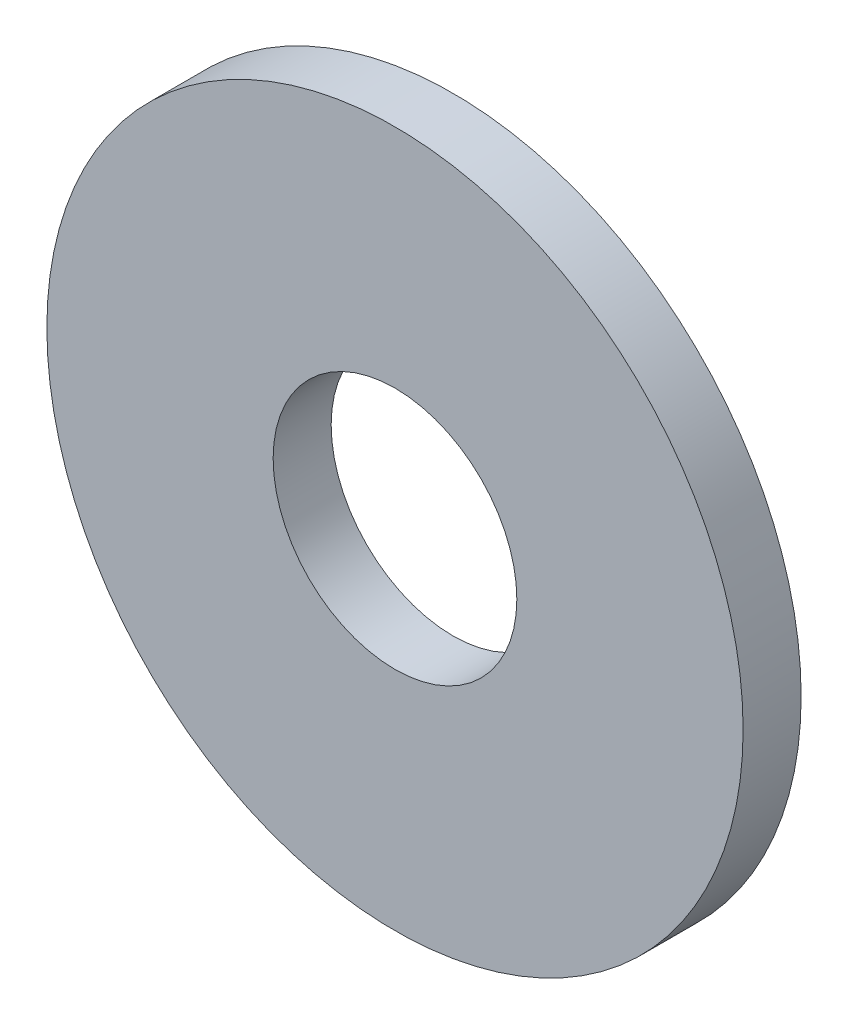
ISO-10303-21;
HEADER;
FILE_DESCRIPTION(('STEP AP214'),'2;1');
FILE_NAME('part.step','',(''),(''),'','','');
FILE_SCHEMA(('AUTOMOTIVE_DESIGN { 1 0 10303 214 1 1 1 1 }'));
ENDSEC;
DATA;
#1=APPLICATION_CONTEXT('core data for automotive mechanical design processes');
#2=APPLICATION_PROTOCOL_DEFINITION('international standard','automotive_design',2000,#1);
#3=PRODUCT_CONTEXT('',#1,'mechanical');
#4=PRODUCT('Part','Part','',(#3));
#5=PRODUCT_RELATED_PRODUCT_CATEGORY('part','',(#4));
#6=PRODUCT_DEFINITION_FORMATION('','',#4);
#7=PRODUCT_DEFINITION_CONTEXT('part definition',#1,'design');
#8=PRODUCT_DEFINITION('design','',#6,#7);
#9=PRODUCT_DEFINITION_SHAPE('','',#8);
#10=(LENGTH_UNIT() NAMED_UNIT(*) SI_UNIT(.MILLI.,.METRE.));
#11=(NAMED_UNIT(*) PLANE_ANGLE_UNIT() SI_UNIT($,.RADIAN.));
#12=(NAMED_UNIT(*) SI_UNIT($,.STERADIAN.) SOLID_ANGLE_UNIT());
#13=UNCERTAINTY_MEASURE_WITH_UNIT(LENGTH_MEASURE(1.E-05),#10,'distance_accuracy_value','');
#14=(GEOMETRIC_REPRESENTATION_CONTEXT(3) GLOBAL_UNCERTAINTY_ASSIGNED_CONTEXT((#13)) GLOBAL_UNIT_ASSIGNED_CONTEXT((#10,
#11,#12)) REPRESENTATION_CONTEXT('',''));
#15=CARTESIAN_POINT('',(0.,0.,0.));
#16=DIRECTION('',(0.,0.,1.));
#17=DIRECTION('',(1.,0.,0.));
#18=AXIS2_PLACEMENT_3D('',#15,#16,#17);
#19=CARTESIAN_POINT('',(0.,0.,1.25));
#20=DIRECTION('',(0.,0.,1.));
#21=DIRECTION('',(1.,0.,0.));
#22=AXIS2_PLACEMENT_3D('',#19,#20,#21);
#23=PLANE('',#22);
#24=CARTESIAN_POINT('',(0.,0.,1.25));
#25=DIRECTION('',(0.,0.,1.));
#26=DIRECTION('',(1.,0.,0.));
#27=AXIS2_PLACEMENT_3D('',#24,#25,#26);
#28=CIRCLE('',#27,15.);
#29=CARTESIAN_POINT('',(15.,0.,1.25));
#30=VERTEX_POINT('',#29);
#31=EDGE_CURVE('E10',#30,#30,#28,.T.);
#32=ORIENTED_EDGE('',*,*,#31,.T.);
#33=EDGE_LOOP('',(#32));
#34=FACE_BOUND('',#33,.T.);
#35=CARTESIAN_POINT('',(0.,0.,1.25));
#36=DIRECTION('',(0.,0.,1.));
#37=DIRECTION('',(1.,0.,0.));
#38=AXIS2_PLACEMENT_3D('',#35,#36,#37);
#39=CIRCLE('',#38,5.25);
#40=CARTESIAN_POINT('',(5.25,0.,1.25));
#41=VERTEX_POINT('',#40);
#42=EDGE_CURVE('E43',#41,#41,#39,.T.);
#43=ORIENTED_EDGE('',*,*,#42,.F.);
#44=EDGE_LOOP('',(#43));
#45=FACE_BOUND('',#44,.T.);
#46=ADVANCED_FACE('F32',(#34,#45),#23,.T.);
#47=CARTESIAN_POINT('',(0.,0.,-1.25));
#48=DIRECTION('',(0.,0.,1.));
#49=DIRECTION('',(1.,0.,0.));
#50=AXIS2_PLACEMENT_3D('',#47,#48,#49);
#51=PLANE('',#50);
#52=CARTESIAN_POINT('',(0.,0.,-1.25));
#53=DIRECTION('',(0.,0.,1.));
#54=DIRECTION('',(1.,0.,0.));
#55=AXIS2_PLACEMENT_3D('',#52,#53,#54);
#56=CIRCLE('',#55,15.);
#57=CARTESIAN_POINT('',(15.,0.,-1.25));
#58=VERTEX_POINT('',#57);
#59=EDGE_CURVE('E36',#58,#58,#56,.T.);
#60=ORIENTED_EDGE('',*,*,#59,.F.);
#61=EDGE_LOOP('',(#60));
#62=FACE_BOUND('',#61,.T.);
#63=CARTESIAN_POINT('',(0.,0.,-1.25));
#64=DIRECTION('',(0.,0.,1.));
#65=DIRECTION('',(1.,0.,0.));
#66=AXIS2_PLACEMENT_3D('',#63,#64,#65);
#67=CIRCLE('',#66,5.25);
#68=CARTESIAN_POINT('',(5.25,0.,-1.25));
#69=VERTEX_POINT('',#68);
#70=EDGE_CURVE('E45',#69,#69,#67,.T.);
#71=ORIENTED_EDGE('',*,*,#70,.T.);
#72=EDGE_LOOP('',(#71));
#73=FACE_BOUND('',#72,.T.);
#74=ADVANCED_FACE('F55',(#62,#73),#51,.F.);
#75=CARTESIAN_POINT('',(0.,0.,1.25));
#76=DIRECTION('',(0.,0.,-1.));
#77=DIRECTION('',(-1.,0.,0.));
#78=AXIS2_PLACEMENT_3D('',#75,#76,#77);
#79=CYLINDRICAL_SURFACE('',#78,15.);
#80=ORIENTED_EDGE('',*,*,#31,.F.);
#81=EDGE_LOOP('',(#80));
#82=FACE_BOUND('',#81,.T.);
#83=ORIENTED_EDGE('',*,*,#59,.T.);
#84=EDGE_LOOP('',(#83));
#85=FACE_BOUND('',#84,.T.);
#86=ADVANCED_FACE('F34',(#82,#85),#79,.T.);
#87=CARTESIAN_POINT('',(0.,0.,1.25));
#88=DIRECTION('',(0.,0.,-1.));
#89=DIRECTION('',(-1.,0.,0.));
#90=AXIS2_PLACEMENT_3D('',#87,#88,#89);
#91=CYLINDRICAL_SURFACE('',#90,5.25);
#92=ORIENTED_EDGE('',*,*,#42,.T.);
#93=EDGE_LOOP('',(#92));
#94=FACE_BOUND('',#93,.T.);
#95=ORIENTED_EDGE('',*,*,#70,.F.);
#96=EDGE_LOOP('',(#95));
#97=FACE_BOUND('',#96,.T.);
#98=ADVANCED_FACE('F51',(#94,#97),#91,.F.);
#99=CLOSED_SHELL('',(#46,#74,#86,#98));
#100=MANIFOLD_SOLID_BREP('B2',#99);
#101=ADVANCED_BREP_SHAPE_REPRESENTATION('',(#18,#100),#14);
#102=SHAPE_DEFINITION_REPRESENTATION(#9,#101);
ENDSEC;
END-ISO-10303-21;
